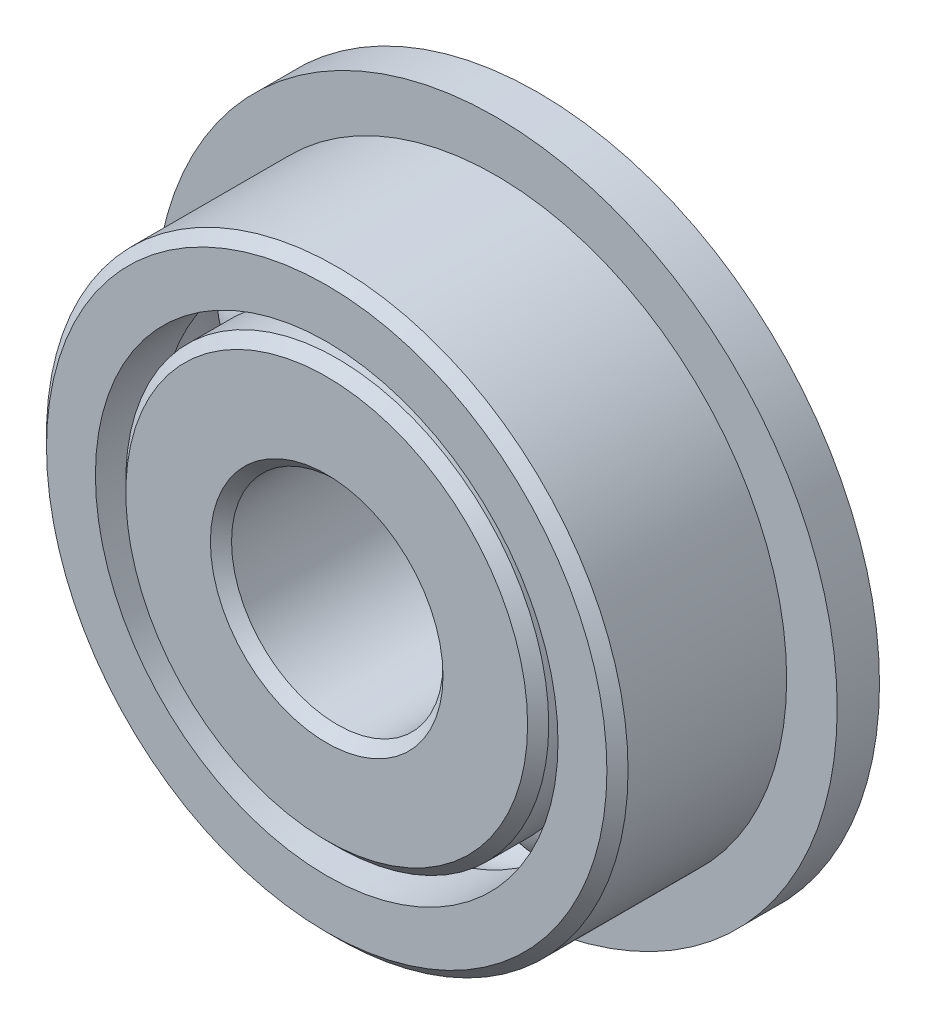
ISO-10303-21;
HEADER;
FILE_DESCRIPTION(('STEP AP214'),'2;1');
FILE_NAME('part.step','',(''),(''),'','','');
FILE_SCHEMA(('AUTOMOTIVE_DESIGN { 1 0 10303 214 1 1 1 1 }'));
ENDSEC;
DATA;
#1=APPLICATION_CONTEXT('core data for automotive mechanical design processes');
#2=APPLICATION_PROTOCOL_DEFINITION('international standard','automotive_design',2000,#1);
#3=PRODUCT_CONTEXT('',#1,'mechanical');
#4=PRODUCT('Part','Part','',(#3));
#5=PRODUCT_RELATED_PRODUCT_CATEGORY('part','',(#4));
#6=PRODUCT_DEFINITION_FORMATION('','',#4);
#7=PRODUCT_DEFINITION_CONTEXT('part definition',#1,'design');
#8=PRODUCT_DEFINITION('design','',#6,#7);
#9=PRODUCT_DEFINITION_SHAPE('','',#8);
#10=(LENGTH_UNIT() NAMED_UNIT(*) SI_UNIT(.MILLI.,.METRE.));
#11=(NAMED_UNIT(*) PLANE_ANGLE_UNIT() SI_UNIT($,.RADIAN.));
#12=(NAMED_UNIT(*) SI_UNIT($,.STERADIAN.) SOLID_ANGLE_UNIT());
#13=UNCERTAINTY_MEASURE_WITH_UNIT(LENGTH_MEASURE(1.E-05),#10,'distance_accuracy_value','');
#14=(GEOMETRIC_REPRESENTATION_CONTEXT(3) GLOBAL_UNCERTAINTY_ASSIGNED_CONTEXT((#13)) GLOBAL_UNIT_ASSIGNED_CONTEXT((#10,
#11,#12)) REPRESENTATION_CONTEXT('',''));
#15=CARTESIAN_POINT('',(0.,0.,0.));
#16=DIRECTION('',(0.,0.,1.));
#17=DIRECTION('',(1.,0.,0.));
#18=AXIS2_PLACEMENT_3D('',#15,#16,#17);
#19=CARTESIAN_POINT('',(-4.20949505675111,4.20949505675122,0.));
#20=DIRECTION('',(0.,0.,1.));
#21=DIRECTION('',(-0.707106781186539,0.707106781186556,0.));
#22=AXIS2_PLACEMENT_3D('',#19,#20,#21);
#23=SPHERICAL_SURFACE('',#22,1.5875);
#24=CARTESIAN_POINT('',(-4.20949505675111,4.20949505675122,1.5875));
#25=VERTEX_POINT('',#24);
#26=VERTEX_LOOP('',#25);
#27=FACE_BOUND('',#26,.T.);
#28=ADVANCED_FACE('F37',(#27),#23,.T.);
#29=CLOSED_SHELL('',(#28));
#30=MANIFOLD_SOLID_BREP('B2',#29);
#31=CARTESIAN_POINT('',(-5.953125,0.,0.));
#32=DIRECTION('',(0.,0.,1.));
#33=DIRECTION('',(-1.,0.,0.));
#34=AXIS2_PLACEMENT_3D('',#31,#32,#33);
#35=SPHERICAL_SURFACE('',#34,1.5875);
#36=CARTESIAN_POINT('',(-5.953125,0.,1.5875));
#37=VERTEX_POINT('',#36);
#38=VERTEX_LOOP('',#37);
#39=FACE_BOUND('',#38,.T.);
#40=ADVANCED_FACE('F57',(#39),#35,.T.);
#41=CLOSED_SHELL('',(#40));
#42=MANIFOLD_SOLID_BREP('B6',#41);
#43=CARTESIAN_POINT('',(-4.2094950567512,-4.20949505675113,0.));
#44=DIRECTION('',(0.,0.,1.));
#45=DIRECTION('',(-0.707106781186554,-0.707106781186541,0.));
#46=AXIS2_PLACEMENT_3D('',#43,#44,#45);
#47=SPHERICAL_SURFACE('',#46,1.5875);
#48=CARTESIAN_POINT('',(-4.2094950567512,-4.20949505675113,1.5875));
#49=VERTEX_POINT('',#48);
#50=VERTEX_LOOP('',#49);
#51=FACE_BOUND('',#50,.T.);
#52=ADVANCED_FACE('F77',(#51),#47,.T.);
#53=CLOSED_SHELL('',(#52));
#54=MANIFOLD_SOLID_BREP('B33',#53);
#55=CARTESIAN_POINT('',(0.,-5.953125,0.));
#56=DIRECTION('',(0.,0.,1.));
#57=DIRECTION('',(0.,-1.,0.));
#58=AXIS2_PLACEMENT_3D('',#55,#56,#57);
#59=SPHERICAL_SURFACE('',#58,1.5875);
#60=CARTESIAN_POINT('',(0.,-5.953125,1.5875));
#61=VERTEX_POINT('',#60);
#62=VERTEX_LOOP('',#61);
#63=FACE_BOUND('',#62,.T.);
#64=ADVANCED_FACE('F97',(#63),#59,.T.);
#65=CLOSED_SHELL('',(#64));
#66=MANIFOLD_SOLID_BREP('B53',#65);
#67=CARTESIAN_POINT('',(4.20949505675114,-4.20949505675119,0.));
#68=DIRECTION('',(0.,0.,1.));
#69=DIRECTION('',(0.707106781186544,-0.707106781186551,0.));
#70=AXIS2_PLACEMENT_3D('',#67,#68,#69);
#71=SPHERICAL_SURFACE('',#70,1.5875);
#72=CARTESIAN_POINT('',(4.20949505675114,-4.20949505675119,1.5875));
#73=VERTEX_POINT('',#72);
#74=VERTEX_LOOP('',#73);
#75=FACE_BOUND('',#74,.T.);
#76=ADVANCED_FACE('F117',(#75),#71,.T.);
#77=CLOSED_SHELL('',(#76));
#78=MANIFOLD_SOLID_BREP('B73',#77);
#79=CARTESIAN_POINT('',(5.953125,0.,0.));
#80=DIRECTION('',(0.,0.,1.));
#81=DIRECTION('',(1.,0.,0.));
#82=AXIS2_PLACEMENT_3D('',#79,#80,#81);
#83=SPHERICAL_SURFACE('',#82,1.5875);
#84=CARTESIAN_POINT('',(5.953125,0.,1.5875));
#85=VERTEX_POINT('',#84);
#86=VERTEX_LOOP('',#85);
#87=FACE_BOUND('',#86,.T.);
#88=ADVANCED_FACE('F137',(#87),#83,.T.);
#89=CLOSED_SHELL('',(#88));
#90=MANIFOLD_SOLID_BREP('B93',#89);
#91=CARTESIAN_POINT('',(4.20949505675117,4.20949505675116,0.));
#92=DIRECTION('',(0.,0.,1.));
#93=DIRECTION('',(0.707106781186549,0.707106781186546,0.));
#94=AXIS2_PLACEMENT_3D('',#91,#92,#93);
#95=SPHERICAL_SURFACE('',#94,1.5875);
#96=CARTESIAN_POINT('',(4.20949505675117,4.20949505675116,1.5875));
#97=VERTEX_POINT('',#96);
#98=VERTEX_LOOP('',#97);
#99=FACE_BOUND('',#98,.T.);
#100=ADVANCED_FACE('F157',(#99),#95,.T.);
#101=CLOSED_SHELL('',(#100));
#102=MANIFOLD_SOLID_BREP('B113',#101);
#103=CARTESIAN_POINT('',(0.,5.953125,0.));
#104=DIRECTION('',(0.,0.,1.));
#105=DIRECTION('',(0.,1.,0.));
#106=AXIS2_PLACEMENT_3D('',#103,#104,#105);
#107=SPHERICAL_SURFACE('',#106,1.5875);
#108=CARTESIAN_POINT('',(0.,5.953125,1.5875));
#109=VERTEX_POINT('',#108);
#110=VERTEX_LOOP('',#109);
#111=FACE_BOUND('',#110,.T.);
#112=ADVANCED_FACE('F179',(#111),#107,.T.);
#113=CLOSED_SHELL('',(#112));
#114=MANIFOLD_SOLID_BREP('B133',#113);
#115=CARTESIAN_POINT('',(0.,0.,2.8575));
#116=DIRECTION('',(0.,0.,-1.));
#117=DIRECTION('',(-1.,0.,0.));
#118=AXIS2_PLACEMENT_3D('',#115,#116,#117);
#119=CONICAL_SURFACE('',#118,6.35,0.785398163397448);
#120=CARTESIAN_POINT('',(0.,0.,3.175));
#121=DIRECTION('',(0.,0.,1.));
#122=DIRECTION('',(1.,0.,0.));
#123=AXIS2_PLACEMENT_3D('',#120,#121,#122);
#124=CIRCLE('',#123,6.0325);
#125=CARTESIAN_POINT('',(6.0325,0.,3.175));
#126=VERTEX_POINT('',#125);
#127=EDGE_CURVE('E178',#126,#126,#124,.T.);
#128=ORIENTED_EDGE('',*,*,#127,.F.);
#129=EDGE_LOOP('',(#128));
#130=FACE_BOUND('',#129,.T.);
#131=CARTESIAN_POINT('',(0.,0.,2.8575));
#132=DIRECTION('',(0.,0.,1.));
#133=DIRECTION('',(1.,0.,0.));
#134=AXIS2_PLACEMENT_3D('',#131,#132,#133);
#135=CIRCLE('',#134,6.35);
#136=CARTESIAN_POINT('',(6.35,0.,2.8575));
#137=VERTEX_POINT('',#136);
#138=EDGE_CURVE('E232',#137,#137,#135,.T.);
#139=ORIENTED_EDGE('',*,*,#138,.T.);
#140=EDGE_LOOP('',(#139));
#141=FACE_BOUND('',#140,.T.);
#142=ADVANCED_FACE('F198',(#130,#141),#119,.T.);
#143=CARTESIAN_POINT('',(0.,3.4925,3.175));
#144=DIRECTION('',(0.,0.,-1.));
#145=DIRECTION('',(-1.,0.,0.));
#146=AXIS2_PLACEMENT_3D('',#143,#144,#145);
#147=PLANE('',#146);
#148=CARTESIAN_POINT('',(0.,0.,3.175));
#149=DIRECTION('',(0.,0.,1.));
#150=DIRECTION('',(1.,0.,0.));
#151=AXIS2_PLACEMENT_3D('',#148,#149,#150);
#152=CIRCLE('',#151,3.4925);
#153=CARTESIAN_POINT('',(3.4925,0.,3.175));
#154=VERTEX_POINT('',#153);
#155=EDGE_CURVE('E204',#154,#154,#152,.T.);
#156=ORIENTED_EDGE('',*,*,#155,.F.);
#157=EDGE_LOOP('',(#156));
#158=FACE_BOUND('',#157,.T.);
#159=ORIENTED_EDGE('',*,*,#127,.T.);
#160=EDGE_LOOP('',(#159));
#161=FACE_BOUND('',#160,.T.);
#162=ADVANCED_FACE('F281',(#158,#161),#147,.F.);
#163=CARTESIAN_POINT('',(0.,0.,3.175));
#164=DIRECTION('',(0.,0.,1.));
#165=DIRECTION('',(1.,0.,0.));
#166=AXIS2_PLACEMENT_3D('',#163,#164,#165);
#167=CONICAL_SURFACE('',#166,3.4925,0.785398163397448);
#168=CARTESIAN_POINT('',(0.,0.,2.8575));
#169=DIRECTION('',(0.,0.,1.));
#170=DIRECTION('',(1.,0.,0.));
#171=AXIS2_PLACEMENT_3D('',#168,#169,#170);
#172=CIRCLE('',#171,3.175);
#173=CARTESIAN_POINT('',(3.175,0.,2.8575));
#174=VERTEX_POINT('',#173);
#175=EDGE_CURVE('E208',#174,#174,#172,.T.);
#176=ORIENTED_EDGE('',*,*,#175,.F.);
#177=EDGE_LOOP('',(#176));
#178=FACE_BOUND('',#177,.T.);
#179=ORIENTED_EDGE('',*,*,#155,.T.);
#180=EDGE_LOOP('',(#179));
#181=FACE_BOUND('',#180,.T.);
#182=ADVANCED_FACE('F276',(#178,#181),#167,.F.);
#183=CARTESIAN_POINT('',(0.,0.,3.175));
#184=DIRECTION('',(0.,0.,1.));
#185=DIRECTION('',(1.,0.,0.));
#186=AXIS2_PLACEMENT_3D('',#183,#184,#185);
#187=CYLINDRICAL_SURFACE('',#186,3.175);
#188=CARTESIAN_POINT('',(0.,0.,-4.4577));
#189=DIRECTION('',(0.,0.,1.));
#190=DIRECTION('',(1.,0.,0.));
#191=AXIS2_PLACEMENT_3D('',#188,#189,#190);
#192=CIRCLE('',#191,3.175);
#193=CARTESIAN_POINT('',(3.175,0.,-4.4577));
#194=VERTEX_POINT('',#193);
#195=EDGE_CURVE('E212',#194,#194,#192,.T.);
#196=ORIENTED_EDGE('',*,*,#195,.F.);
#197=EDGE_LOOP('',(#196));
#198=FACE_BOUND('',#197,.T.);
#199=ORIENTED_EDGE('',*,*,#175,.T.);
#200=EDGE_LOOP('',(#199));
#201=FACE_BOUND('',#200,.T.);
#202=ADVANCED_FACE('F270',(#198,#201),#187,.F.);
#203=CARTESIAN_POINT('',(0.,0.,-4.4577));
#204=DIRECTION('',(0.,0.,-1.));
#205=DIRECTION('',(-1.,0.,0.));
#206=AXIS2_PLACEMENT_3D('',#203,#204,#205);
#207=CONICAL_SURFACE('',#206,3.175,0.785398163397443);
#208=CARTESIAN_POINT('',(0.,0.,-4.7752));
#209=DIRECTION('',(0.,0.,1.));
#210=DIRECTION('',(1.,0.,0.));
#211=AXIS2_PLACEMENT_3D('',#208,#209,#210);
#212=CIRCLE('',#211,3.4925);
#213=CARTESIAN_POINT('',(3.4925,0.,-4.7752));
#214=VERTEX_POINT('',#213);
#215=EDGE_CURVE('E217',#214,#214,#212,.T.);
#216=ORIENTED_EDGE('',*,*,#215,.F.);
#217=EDGE_LOOP('',(#216));
#218=FACE_BOUND('',#217,.T.);
#219=ORIENTED_EDGE('',*,*,#195,.T.);
#220=EDGE_LOOP('',(#219));
#221=FACE_BOUND('',#220,.T.);
#222=ADVANCED_FACE('F264',(#218,#221),#207,.F.);
#223=CARTESIAN_POINT('',(0.,6.0325,-4.7752));
#224=DIRECTION('',(0.,0.,1.));
#225=DIRECTION('',(1.,0.,0.));
#226=AXIS2_PLACEMENT_3D('',#223,#224,#225);
#227=PLANE('',#226);
#228=CARTESIAN_POINT('',(0.,0.,-4.7752));
#229=DIRECTION('',(0.,0.,1.));
#230=DIRECTION('',(1.,0.,0.));
#231=AXIS2_PLACEMENT_3D('',#228,#229,#230);
#232=CIRCLE('',#231,6.0325);
#233=CARTESIAN_POINT('',(6.0325,0.,-4.7752));
#234=VERTEX_POINT('',#233);
#235=EDGE_CURVE('E220',#234,#234,#232,.T.);
#236=ORIENTED_EDGE('',*,*,#235,.F.);
#237=EDGE_LOOP('',(#236));
#238=FACE_BOUND('',#237,.T.);
#239=ORIENTED_EDGE('',*,*,#215,.T.);
#240=EDGE_LOOP('',(#239));
#241=FACE_BOUND('',#240,.T.);
#242=ADVANCED_FACE('F258',(#238,#241),#227,.F.);
#243=CARTESIAN_POINT('',(0.,0.,-4.7752));
#244=DIRECTION('',(0.,0.,1.));
#245=DIRECTION('',(1.,0.,0.));
#246=AXIS2_PLACEMENT_3D('',#243,#244,#245);
#247=CONICAL_SURFACE('',#246,6.0325,0.785398163397444);
#248=CARTESIAN_POINT('',(0.,0.,-4.4577));
#249=DIRECTION('',(0.,0.,1.));
#250=DIRECTION('',(1.,0.,0.));
#251=AXIS2_PLACEMENT_3D('',#248,#249,#250);
#252=CIRCLE('',#251,6.35);
#253=CARTESIAN_POINT('',(6.35,0.,-4.4577));
#254=VERTEX_POINT('',#253);
#255=EDGE_CURVE('E223',#254,#254,#252,.T.);
#256=ORIENTED_EDGE('',*,*,#255,.F.);
#257=EDGE_LOOP('',(#256));
#258=FACE_BOUND('',#257,.T.);
#259=ORIENTED_EDGE('',*,*,#235,.T.);
#260=EDGE_LOOP('',(#259));
#261=FACE_BOUND('',#260,.T.);
#262=ADVANCED_FACE('F252',(#258,#261),#247,.T.);
#263=CARTESIAN_POINT('',(0.,0.,3.175));
#264=DIRECTION('',(0.,0.,1.));
#265=DIRECTION('',(1.,0.,0.));
#266=AXIS2_PLACEMENT_3D('',#263,#264,#265);
#267=CYLINDRICAL_SURFACE('',#266,6.35);
#268=CARTESIAN_POINT('',(0.,0.,-1.53709026552607));
#269=DIRECTION('',(0.,0.,1.));
#270=DIRECTION('',(1.,0.,0.));
#271=AXIS2_PLACEMENT_3D('',#268,#269,#270);
#272=CIRCLE('',#271,6.35);
#273=CARTESIAN_POINT('',(6.35,0.,-1.53709026552607));
#274=VERTEX_POINT('',#273);
#275=EDGE_CURVE('E226',#274,#274,#272,.T.);
#276=ORIENTED_EDGE('',*,*,#275,.F.);
#277=EDGE_LOOP('',(#276));
#278=FACE_BOUND('',#277,.T.);
#279=ORIENTED_EDGE('',*,*,#255,.T.);
#280=EDGE_LOOP('',(#279));
#281=FACE_BOUND('',#280,.T.);
#282=ADVANCED_FACE('F246',(#278,#281),#267,.T.);
#283=CARTESIAN_POINT('',(0.,0.,0.));
#284=DIRECTION('',(0.,0.,1.));
#285=DIRECTION('',(1.,0.,0.));
#286=AXIS2_PLACEMENT_3D('',#283,#284,#285);
#287=TOROIDAL_SURFACE('',#286,5.953125,1.5875);
#288=CARTESIAN_POINT('',(0.,0.,1.53709026552607));
#289=DIRECTION('',(0.,0.,1.));
#290=DIRECTION('',(1.,0.,0.));
#291=AXIS2_PLACEMENT_3D('',#288,#289,#290);
#292=CIRCLE('',#291,6.35);
#293=CARTESIAN_POINT('',(6.35,0.,1.53709026552607));
#294=VERTEX_POINT('',#293);
#295=EDGE_CURVE('E229',#294,#294,#292,.T.);
#296=ORIENTED_EDGE('',*,*,#295,.F.);
#297=EDGE_LOOP('',(#296));
#298=FACE_BOUND('',#297,.T.);
#299=ORIENTED_EDGE('',*,*,#275,.T.);
#300=EDGE_LOOP('',(#299));
#301=FACE_BOUND('',#300,.T.);
#302=ADVANCED_FACE('F240',(#298,#301),#287,.F.);
#303=CARTESIAN_POINT('',(0.,0.,3.175));
#304=DIRECTION('',(0.,0.,1.));
#305=DIRECTION('',(1.,0.,0.));
#306=AXIS2_PLACEMENT_3D('',#303,#304,#305);
#307=CYLINDRICAL_SURFACE('',#306,6.35);
#308=ORIENTED_EDGE('',*,*,#138,.F.);
#309=EDGE_LOOP('',(#308));
#310=FACE_BOUND('',#309,.T.);
#311=ORIENTED_EDGE('',*,*,#295,.T.);
#312=EDGE_LOOP('',(#311));
#313=FACE_BOUND('',#312,.T.);
#314=ADVANCED_FACE('F237',(#310,#313),#307,.T.);
#315=CLOSED_SHELL('',(#142,#162,#182,#202,#222,#242,#262,#282,#302,#314));
#316=MANIFOLD_SOLID_BREP('B153',#315);
#317=CARTESIAN_POINT('',(0.,0.,2.8575));
#318=DIRECTION('',(0.,0.,-1.));
#319=DIRECTION('',(-1.,0.,0.));
#320=AXIS2_PLACEMENT_3D('',#317,#318,#319);
#321=CONICAL_SURFACE('',#320,8.73125,0.785398163397445);
#322=CARTESIAN_POINT('',(0.,0.,3.175));
#323=DIRECTION('',(0.,0.,1.));
#324=DIRECTION('',(1.,0.,0.));
#325=AXIS2_PLACEMENT_3D('',#322,#323,#324);
#326=CIRCLE('',#325,8.41375);
#327=CARTESIAN_POINT('',(8.41375,0.,3.175));
#328=VERTEX_POINT('',#327);
#329=EDGE_CURVE('E371',#328,#328,#326,.T.);
#330=ORIENTED_EDGE('',*,*,#329,.F.);
#331=EDGE_LOOP('',(#330));
#332=FACE_BOUND('',#331,.T.);
#333=CARTESIAN_POINT('',(0.,0.,2.8575));
#334=DIRECTION('',(0.,0.,1.));
#335=DIRECTION('',(1.,0.,0.));
#336=AXIS2_PLACEMENT_3D('',#333,#334,#335);
#337=CIRCLE('',#336,8.73125);
#338=CARTESIAN_POINT('',(8.73125,0.,2.8575));
#339=VERTEX_POINT('',#338);
#340=EDGE_CURVE('E197',#339,#339,#337,.T.);
#341=ORIENTED_EDGE('',*,*,#340,.T.);
#342=EDGE_LOOP('',(#341));
#343=FACE_BOUND('',#342,.T.);
#344=ADVANCED_FACE('F349',(#332,#343),#321,.T.);
#345=CARTESIAN_POINT('',(0.,0.,3.175));
#346=DIRECTION('',(0.,0.,1.));
#347=DIRECTION('',(1.,0.,0.));
#348=AXIS2_PLACEMENT_3D('',#345,#346,#347);
#349=CYLINDRICAL_SURFACE('',#348,8.73125);
#350=CARTESIAN_POINT('',(0.,0.,-1.905));
#351=DIRECTION('',(0.,0.,1.));
#352=DIRECTION('',(1.,0.,0.));
#353=AXIS2_PLACEMENT_3D('',#350,#351,#352);
#354=CIRCLE('',#353,8.73125);
#355=CARTESIAN_POINT('',(8.73125,0.,-1.905));
#356=VERTEX_POINT('',#355);
#357=EDGE_CURVE('E374',#356,#356,#354,.T.);
#358=ORIENTED_EDGE('',*,*,#357,.T.);
#359=EDGE_LOOP('',(#358));
#360=FACE_BOUND('',#359,.T.);
#361=ORIENTED_EDGE('',*,*,#340,.F.);
#362=EDGE_LOOP('',(#361));
#363=FACE_BOUND('',#362,.T.);
#364=ADVANCED_FACE('F394',(#360,#363),#349,.T.);
#365=CARTESIAN_POINT('',(0.,8.41375,-3.175));
#366=DIRECTION('',(0.,0.,1.));
#367=DIRECTION('',(1.,0.,0.));
#368=AXIS2_PLACEMENT_3D('',#365,#366,#367);
#369=PLANE('',#368);
#370=CARTESIAN_POINT('',(0.,0.,-3.175));
#371=DIRECTION('',(0.,0.,1.));
#372=DIRECTION('',(1.,0.,0.));
#373=AXIS2_PLACEMENT_3D('',#370,#371,#372);
#374=CIRCLE('',#373,6.9453125);
#375=CARTESIAN_POINT('',(6.9453125,0.,-3.175));
#376=VERTEX_POINT('',#375);
#377=EDGE_CURVE('E355',#376,#376,#374,.T.);
#378=ORIENTED_EDGE('',*,*,#377,.T.);
#379=EDGE_LOOP('',(#378));
#380=FACE_BOUND('',#379,.T.);
#381=CARTESIAN_POINT('',(0.,0.,-3.175));
#382=DIRECTION('',(0.,0.,-1.));
#383=DIRECTION('',(-1.,0.,0.));
#384=AXIS2_PLACEMENT_3D('',#381,#382,#383);
#385=CIRCLE('',#384,10.2489);
#386=CARTESIAN_POINT('',(-10.2489,0.,-3.175));
#387=VERTEX_POINT('',#386);
#388=EDGE_CURVE('E377',#387,#387,#385,.T.);
#389=ORIENTED_EDGE('',*,*,#388,.T.);
#390=EDGE_LOOP('',(#389));
#391=FACE_BOUND('',#390,.T.);
#392=ADVANCED_FACE('F397',(#380,#391),#369,.F.);
#393=CARTESIAN_POINT('',(0.,0.,3.175));
#394=DIRECTION('',(0.,0.,1.));
#395=DIRECTION('',(1.,0.,0.));
#396=AXIS2_PLACEMENT_3D('',#393,#394,#395);
#397=CYLINDRICAL_SURFACE('',#396,6.9453125);
#398=CARTESIAN_POINT('',(0.,0.,-1.23924179030718));
#399=DIRECTION('',(0.,0.,1.));
#400=DIRECTION('',(1.,0.,0.));
#401=AXIS2_PLACEMENT_3D('',#398,#399,#400);
#402=CIRCLE('',#401,6.9453125);
#403=CARTESIAN_POINT('',(6.9453125,0.,-1.23924179030718));
#404=VERTEX_POINT('',#403);
#405=EDGE_CURVE('E359',#404,#404,#402,.T.);
#406=ORIENTED_EDGE('',*,*,#405,.T.);
#407=EDGE_LOOP('',(#406));
#408=FACE_BOUND('',#407,.T.);
#409=ORIENTED_EDGE('',*,*,#377,.F.);
#410=EDGE_LOOP('',(#409));
#411=FACE_BOUND('',#410,.T.);
#412=ADVANCED_FACE('F402',(#408,#411),#397,.F.);
#413=CARTESIAN_POINT('',(0.,0.,0.));
#414=DIRECTION('',(0.,0.,1.));
#415=DIRECTION('',(1.,0.,0.));
#416=AXIS2_PLACEMENT_3D('',#413,#414,#415);
#417=TOROIDAL_SURFACE('',#416,5.953125,1.5875);
#418=ORIENTED_EDGE('',*,*,#405,.F.);
#419=EDGE_LOOP('',(#418));
#420=FACE_BOUND('',#419,.T.);
#421=CARTESIAN_POINT('',(0.,0.,1.23924179030719));
#422=DIRECTION('',(0.,0.,1.));
#423=DIRECTION('',(1.,0.,0.));
#424=AXIS2_PLACEMENT_3D('',#421,#422,#423);
#425=CIRCLE('',#424,6.9453125);
#426=CARTESIAN_POINT('',(6.9453125,0.,1.23924179030719));
#427=VERTEX_POINT('',#426);
#428=EDGE_CURVE('E363',#427,#427,#425,.T.);
#429=ORIENTED_EDGE('',*,*,#428,.T.);
#430=EDGE_LOOP('',(#429));
#431=FACE_BOUND('',#430,.T.);
#432=ADVANCED_FACE('F408',(#420,#431),#417,.F.);
#433=CARTESIAN_POINT('',(0.,0.,3.175));
#434=DIRECTION('',(0.,0.,1.));
#435=DIRECTION('',(1.,0.,0.));
#436=AXIS2_PLACEMENT_3D('',#433,#434,#435);
#437=CYLINDRICAL_SURFACE('',#436,6.9453125);
#438=ORIENTED_EDGE('',*,*,#428,.F.);
#439=EDGE_LOOP('',(#438));
#440=FACE_BOUND('',#439,.T.);
#441=CARTESIAN_POINT('',(0.,0.,3.175));
#442=DIRECTION('',(0.,0.,1.));
#443=DIRECTION('',(1.,0.,0.));
#444=AXIS2_PLACEMENT_3D('',#441,#442,#443);
#445=CIRCLE('',#444,6.9453125);
#446=CARTESIAN_POINT('',(6.9453125,0.,3.175));
#447=VERTEX_POINT('',#446);
#448=EDGE_CURVE('E368',#447,#447,#445,.T.);
#449=ORIENTED_EDGE('',*,*,#448,.T.);
#450=EDGE_LOOP('',(#449));
#451=FACE_BOUND('',#450,.T.);
#452=ADVANCED_FACE('F412',(#440,#451),#437,.F.);
#453=CARTESIAN_POINT('',(0.,8.41375,3.175));
#454=DIRECTION('',(0.,0.,-1.));
#455=DIRECTION('',(-1.,0.,0.));
#456=AXIS2_PLACEMENT_3D('',#453,#454,#455);
#457=PLANE('',#456);
#458=ORIENTED_EDGE('',*,*,#448,.F.);
#459=EDGE_LOOP('',(#458));
#460=FACE_BOUND('',#459,.T.);
#461=ORIENTED_EDGE('',*,*,#329,.T.);
#462=EDGE_LOOP('',(#461));
#463=FACE_BOUND('',#462,.T.);
#464=ADVANCED_FACE('F390',(#460,#463),#457,.F.);
#465=CARTESIAN_POINT('',(0.,6.9453125,-1.905));
#466=DIRECTION('',(0.,0.,1.));
#467=DIRECTION('',(1.,0.,0.));
#468=AXIS2_PLACEMENT_3D('',#465,#466,#467);
#469=PLANE('',#468);
#470=CARTESIAN_POINT('',(0.,0.,-1.905));
#471=DIRECTION('',(0.,0.,-1.));
#472=DIRECTION('',(-1.,0.,0.));
#473=AXIS2_PLACEMENT_3D('',#470,#471,#472);
#474=CIRCLE('',#473,10.2489);
#475=CARTESIAN_POINT('',(-10.2489,0.,-1.905));
#476=VERTEX_POINT('',#475);
#477=EDGE_CURVE('E380',#476,#476,#474,.T.);
#478=ORIENTED_EDGE('',*,*,#477,.F.);
#479=EDGE_LOOP('',(#478));
#480=FACE_BOUND('',#479,.T.);
#481=ORIENTED_EDGE('',*,*,#357,.F.);
#482=EDGE_LOOP('',(#481));
#483=FACE_BOUND('',#482,.T.);
#484=ADVANCED_FACE('F387',(#480,#483),#469,.T.);
#485=CARTESIAN_POINT('',(0.,0.,-3.175));
#486=DIRECTION('',(0.,0.,-1.));
#487=DIRECTION('',(-1.,0.,0.));
#488=AXIS2_PLACEMENT_3D('',#485,#486,#487);
#489=CYLINDRICAL_SURFACE('',#488,10.2489);
#490=ORIENTED_EDGE('',*,*,#477,.T.);
#491=EDGE_LOOP('',(#490));
#492=FACE_BOUND('',#491,.T.);
#493=ORIENTED_EDGE('',*,*,#388,.F.);
#494=EDGE_LOOP('',(#493));
#495=FACE_BOUND('',#494,.T.);
#496=ADVANCED_FACE('F384',(#492,#495),#489,.T.);
#497=CLOSED_SHELL('',(#344,#364,#392,#412,#432,#452,#464,#484,#496));
#498=MANIFOLD_SOLID_BREP('B173',#497);
#499=ADVANCED_BREP_SHAPE_REPRESENTATION('',(#18,#30,#42,#54,#66,#78,#90,#102,#114,#316,#498),#14);
#500=SHAPE_DEFINITION_REPRESENTATION(#9,#499);
ENDSEC;
END-ISO-10303-21;
